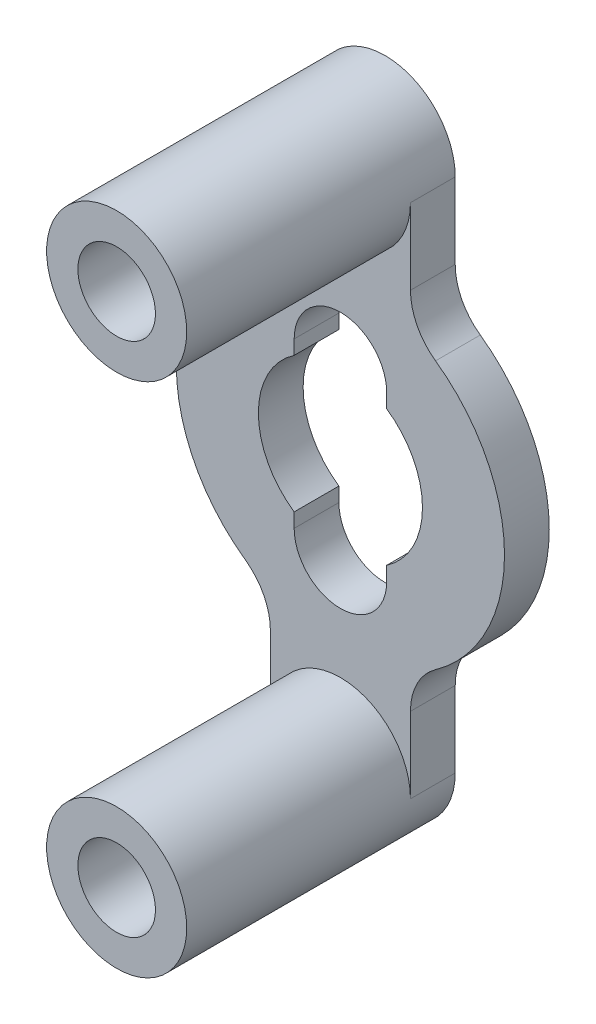
ISO-10303-21;
HEADER;
FILE_DESCRIPTION(('STEP AP214'),'2;1');
FILE_NAME('part.step','',(''),(''),'','','');
FILE_SCHEMA(('AUTOMOTIVE_DESIGN { 1 0 10303 214 1 1 1 1 }'));
ENDSEC;
DATA;
#1=APPLICATION_CONTEXT('core data for automotive mechanical design processes');
#2=APPLICATION_PROTOCOL_DEFINITION('international standard','automotive_design',2000,#1);
#3=PRODUCT_CONTEXT('',#1,'mechanical');
#4=PRODUCT('Part','Part','',(#3));
#5=PRODUCT_RELATED_PRODUCT_CATEGORY('part','',(#4));
#6=PRODUCT_DEFINITION_FORMATION('','',#4);
#7=PRODUCT_DEFINITION_CONTEXT('part definition',#1,'design');
#8=PRODUCT_DEFINITION('design','',#6,#7);
#9=PRODUCT_DEFINITION_SHAPE('','',#8);
#10=(LENGTH_UNIT() NAMED_UNIT(*) SI_UNIT(.MILLI.,.METRE.));
#11=(NAMED_UNIT(*) PLANE_ANGLE_UNIT() SI_UNIT($,.RADIAN.));
#12=(NAMED_UNIT(*) SI_UNIT($,.STERADIAN.) SOLID_ANGLE_UNIT());
#13=UNCERTAINTY_MEASURE_WITH_UNIT(LENGTH_MEASURE(1.E-05),#10,'distance_accuracy_value','');
#14=(GEOMETRIC_REPRESENTATION_CONTEXT(3) GLOBAL_UNCERTAINTY_ASSIGNED_CONTEXT((#13)) GLOBAL_UNIT_ASSIGNED_CONTEXT((#10,
#11,#12)) REPRESENTATION_CONTEXT('',''));
#15=CARTESIAN_POINT('',(0.,0.,0.));
#16=DIRECTION('',(0.,0.,1.));
#17=DIRECTION('',(1.,0.,0.));
#18=AXIS2_PLACEMENT_3D('',#15,#16,#17);
#19=CARTESIAN_POINT('',(-2.34789254737414,0.,1.5));
#20=DIRECTION('',(-1.,0.,0.));
#21=DIRECTION('',(0.,-1.,0.));
#22=AXIS2_PLACEMENT_3D('',#19,#20,#21);
#23=PLANE('',#22);
#24=DIRECTION('',(0.,1.,0.));
#25=VECTOR('',#24,1.);
#26=CARTESIAN_POINT('',(-2.34789254737414,0.,0.));
#27=LINE('',#26,#25);
#28=CARTESIAN_POINT('',(-2.34789254737414,6.11112349707388,0.));
#29=VERTEX_POINT('',#28);
#30=CARTESIAN_POINT('',(-2.34789254737414,8.65210745262587,0.));
#31=VERTEX_POINT('',#30);
#32=EDGE_CURVE('E265',#29,#31,#27,.T.);
#33=ORIENTED_EDGE('',*,*,#32,.F.);
#34=DIRECTION('',(0.,0.,-1.));
#35=VECTOR('',#34,1.);
#36=CARTESIAN_POINT('',(-2.34789254737414,6.11112349707388,1.5));
#37=LINE('',#36,#35);
#38=CARTESIAN_POINT('',(-2.34789254737414,6.11112349707388,1.5));
#39=VERTEX_POINT('',#38);
#40=EDGE_CURVE('E11',#39,#29,#37,.T.);
#41=ORIENTED_EDGE('',*,*,#40,.F.);
#42=DIRECTION('',(0.,1.,0.));
#43=VECTOR('',#42,1.);
#44=CARTESIAN_POINT('',(-2.34789254737414,0.,1.5));
#45=LINE('',#44,#43);
#46=CARTESIAN_POINT('',(-2.34789254737414,8.65210745262587,1.5));
#47=VERTEX_POINT('',#46);
#48=EDGE_CURVE('E312',#39,#47,#45,.T.);
#49=ORIENTED_EDGE('',*,*,#48,.T.);
#50=DIRECTION('',(0.,0.,-1.));
#51=VECTOR('',#50,1.);
#52=CARTESIAN_POINT('',(-2.34789254737414,8.65210745262587,1.5));
#53=LINE('',#52,#51);
#54=EDGE_CURVE('E228',#47,#31,#53,.T.);
#55=ORIENTED_EDGE('',*,*,#54,.T.);
#56=EDGE_LOOP('',(#33,#41,#49,#55));
#57=FACE_BOUND('',#56,.T.);
#58=ADVANCED_FACE('F35',(#57),#23,.T.);
#59=CARTESIAN_POINT('',(-4.34789254737414,6.11112349707388,1.5));
#60=DIRECTION('',(0.,0.,-1.));
#61=DIRECTION('',(-1.,0.,0.));
#62=AXIS2_PLACEMENT_3D('',#59,#60,#61);
#63=CYLINDRICAL_SURFACE('',#62,2.);
#64=CARTESIAN_POINT('',(-4.34789254737414,6.11112349707388,0.));
#65=DIRECTION('',(0.,0.,1.));
#66=DIRECTION('',(1.,0.,0.));
#67=AXIS2_PLACEMENT_3D('',#64,#65,#66);
#68=CIRCLE('',#67,2.);
#69=CARTESIAN_POINT('',(-3.18845453474103,4.48149056452084,0.));
#70=VERTEX_POINT('',#69);
#71=EDGE_CURVE('E262',#29,#70,#68,.F.);
#72=ORIENTED_EDGE('',*,*,#71,.T.);
#73=DIRECTION('',(0.,0.,-1.));
#74=VECTOR('',#73,1.);
#75=CARTESIAN_POINT('',(-3.18845453474103,4.48149056452084,1.5));
#76=LINE('',#75,#74);
#77=CARTESIAN_POINT('',(-3.18845453474103,4.48149056452084,1.5));
#78=VERTEX_POINT('',#77);
#79=EDGE_CURVE('E45',#78,#70,#76,.T.);
#80=ORIENTED_EDGE('',*,*,#79,.F.);
#81=CARTESIAN_POINT('',(-4.34789254737414,6.11112349707388,1.5));
#82=DIRECTION('',(0.,0.,1.));
#83=DIRECTION('',(1.,0.,0.));
#84=AXIS2_PLACEMENT_3D('',#81,#82,#83);
#85=CIRCLE('',#84,2.);
#86=EDGE_CURVE('E309',#39,#78,#85,.F.);
#87=ORIENTED_EDGE('',*,*,#86,.F.);
#88=ORIENTED_EDGE('',*,*,#40,.T.);
#89=EDGE_LOOP('',(#72,#80,#87,#88));
#90=FACE_BOUND('',#89,.T.);
#91=ADVANCED_FACE('F407',(#90),#63,.F.);
#92=CARTESIAN_POINT('',(0.,0.,1.5));
#93=DIRECTION('',(0.,0.,-1.));
#94=DIRECTION('',(-1.,0.,0.));
#95=AXIS2_PLACEMENT_3D('',#92,#93,#94);
#96=CYLINDRICAL_SURFACE('',#95,5.5);
#97=CARTESIAN_POINT('',(0.,0.,0.));
#98=DIRECTION('',(0.,0.,1.));
#99=DIRECTION('',(1.,0.,0.));
#100=AXIS2_PLACEMENT_3D('',#97,#98,#99);
#101=CIRCLE('',#100,5.5);
#102=CARTESIAN_POINT('',(-3.18845453474103,-4.48149056452084,0.));
#103=VERTEX_POINT('',#102);
#104=EDGE_CURVE('E259',#70,#103,#101,.T.);
#105=ORIENTED_EDGE('',*,*,#104,.T.);
#106=DIRECTION('',(0.,0.,-1.));
#107=VECTOR('',#106,1.);
#108=CARTESIAN_POINT('',(-3.18845453474103,-4.48149056452084,1.5));
#109=LINE('',#108,#107);
#110=CARTESIAN_POINT('',(-3.18845453474103,-4.48149056452084,1.5));
#111=VERTEX_POINT('',#110);
#112=EDGE_CURVE('E206',#111,#103,#109,.T.);
#113=ORIENTED_EDGE('',*,*,#112,.F.);
#114=CARTESIAN_POINT('',(0.,0.,1.5));
#115=DIRECTION('',(0.,0.,1.));
#116=DIRECTION('',(1.,0.,0.));
#117=AXIS2_PLACEMENT_3D('',#114,#115,#116);
#118=CIRCLE('',#117,5.5);
#119=EDGE_CURVE('E307',#78,#111,#118,.T.);
#120=ORIENTED_EDGE('',*,*,#119,.F.);
#121=ORIENTED_EDGE('',*,*,#79,.T.);
#122=EDGE_LOOP('',(#105,#113,#120,#121));
#123=FACE_BOUND('',#122,.T.);
#124=ADVANCED_FACE('F412',(#123),#96,.T.);
#125=CARTESIAN_POINT('',(-4.34789254737414,-6.11112349707387,1.5));
#126=DIRECTION('',(0.,0.,-1.));
#127=DIRECTION('',(-1.,0.,0.));
#128=AXIS2_PLACEMENT_3D('',#125,#126,#127);
#129=CYLINDRICAL_SURFACE('',#128,2.);
#130=CARTESIAN_POINT('',(-4.34789254737414,-6.11112349707387,0.));
#131=DIRECTION('',(0.,0.,1.));
#132=DIRECTION('',(1.,0.,0.));
#133=AXIS2_PLACEMENT_3D('',#130,#131,#132);
#134=CIRCLE('',#133,2.);
#135=CARTESIAN_POINT('',(-2.34789254737414,-6.11112349707387,0.));
#136=VERTEX_POINT('',#135);
#137=EDGE_CURVE('E256',#136,#103,#134,.T.);
#138=ORIENTED_EDGE('',*,*,#137,.F.);
#139=DIRECTION('',(0.,0.,-1.));
#140=VECTOR('',#139,1.);
#141=CARTESIAN_POINT('',(-2.34789254737414,-6.11112349707387,1.5));
#142=LINE('',#141,#140);
#143=CARTESIAN_POINT('',(-2.34789254737414,-6.11112349707387,1.5));
#144=VERTEX_POINT('',#143);
#145=EDGE_CURVE('E204',#144,#136,#142,.T.);
#146=ORIENTED_EDGE('',*,*,#145,.F.);
#147=CARTESIAN_POINT('',(-4.34789254737414,-6.11112349707387,1.5));
#148=DIRECTION('',(0.,0.,1.));
#149=DIRECTION('',(1.,0.,0.));
#150=AXIS2_PLACEMENT_3D('',#147,#148,#149);
#151=CIRCLE('',#150,2.);
#152=EDGE_CURVE('E304',#144,#111,#151,.T.);
#153=ORIENTED_EDGE('',*,*,#152,.T.);
#154=ORIENTED_EDGE('',*,*,#112,.T.);
#155=EDGE_LOOP('',(#138,#146,#153,#154));
#156=FACE_BOUND('',#155,.T.);
#157=ADVANCED_FACE('F546',(#156),#129,.F.);
#158=CARTESIAN_POINT('',(-2.34789254737414,0.,1.5));
#159=DIRECTION('',(-1.,0.,0.));
#160=DIRECTION('',(0.,-1.,0.));
#161=AXIS2_PLACEMENT_3D('',#158,#159,#160);
#162=PLANE('',#161);
#163=DIRECTION('',(0.,1.,0.));
#164=VECTOR('',#163,1.);
#165=CARTESIAN_POINT('',(-2.34789254737414,0.,0.));
#166=LINE('',#165,#164);
#167=CARTESIAN_POINT('',(-2.34789254737413,-8.65210745262587,0.));
#168=VERTEX_POINT('',#167);
#169=EDGE_CURVE('E253',#168,#136,#166,.T.);
#170=ORIENTED_EDGE('',*,*,#169,.F.);
#171=DIRECTION('',(0.,0.,-1.));
#172=VECTOR('',#171,1.);
#173=CARTESIAN_POINT('',(-2.34789254737413,-8.65210745262587,1.5));
#174=LINE('',#173,#172);
#175=CARTESIAN_POINT('',(-2.34789254737413,-8.65210745262587,1.5));
#176=VERTEX_POINT('',#175);
#177=EDGE_CURVE('E201',#176,#168,#174,.T.);
#178=ORIENTED_EDGE('',*,*,#177,.F.);
#179=DIRECTION('',(0.,1.,0.));
#180=VECTOR('',#179,1.);
#181=CARTESIAN_POINT('',(-2.34789254737414,0.,1.5));
#182=LINE('',#181,#180);
#183=EDGE_CURVE('E301',#176,#144,#182,.T.);
#184=ORIENTED_EDGE('',*,*,#183,.T.);
#185=ORIENTED_EDGE('',*,*,#145,.T.);
#186=EDGE_LOOP('',(#170,#178,#184,#185));
#187=FACE_BOUND('',#186,.T.);
#188=ADVANCED_FACE('F390',(#187),#162,.T.);
#189=CARTESIAN_POINT('',(2.34789254737413,0.,1.5));
#190=DIRECTION('',(-1.,0.,0.));
#191=DIRECTION('',(0.,-1.,0.));
#192=AXIS2_PLACEMENT_3D('',#189,#190,#191);
#193=PLANE('',#192);
#194=DIRECTION('',(0.,1.,0.));
#195=VECTOR('',#194,1.);
#196=CARTESIAN_POINT('',(2.34789254737413,0.,0.));
#197=LINE('',#196,#195);
#198=CARTESIAN_POINT('',(2.34789254737414,-8.65210745262586,0.));
#199=VERTEX_POINT('',#198);
#200=CARTESIAN_POINT('',(2.34789254737414,-6.11112349707387,0.));
#201=VERTEX_POINT('',#200);
#202=EDGE_CURVE('E250',#199,#201,#197,.T.);
#203=ORIENTED_EDGE('',*,*,#202,.T.);
#204=DIRECTION('',(0.,0.,-1.));
#205=VECTOR('',#204,1.);
#206=CARTESIAN_POINT('',(2.34789254737414,-6.11112349707387,1.5));
#207=LINE('',#206,#205);
#208=CARTESIAN_POINT('',(2.34789254737414,-6.11112349707387,1.5));
#209=VERTEX_POINT('',#208);
#210=EDGE_CURVE('E192',#209,#201,#207,.T.);
#211=ORIENTED_EDGE('',*,*,#210,.F.);
#212=DIRECTION('',(0.,1.,0.));
#213=VECTOR('',#212,1.);
#214=CARTESIAN_POINT('',(2.34789254737413,0.,1.5));
#215=LINE('',#214,#213);
#216=CARTESIAN_POINT('',(2.34789254737414,-8.65210745262587,1.5));
#217=VERTEX_POINT('',#216);
#218=EDGE_CURVE('E185',#217,#209,#215,.T.);
#219=ORIENTED_EDGE('',*,*,#218,.F.);
#220=DIRECTION('',(0.,0.,-1.));
#221=VECTOR('',#220,1.);
#222=CARTESIAN_POINT('',(2.34789254737414,-8.65210745262587,1.5));
#223=LINE('',#222,#221);
#224=EDGE_CURVE('E194',#217,#199,#223,.T.);
#225=ORIENTED_EDGE('',*,*,#224,.T.);
#226=EDGE_LOOP('',(#203,#211,#219,#225));
#227=FACE_BOUND('',#226,.T.);
#228=ADVANCED_FACE('F385',(#227),#193,.F.);
#229=CARTESIAN_POINT('',(4.34789254737414,-6.11112349707387,1.5));
#230=DIRECTION('',(0.,0.,-1.));
#231=DIRECTION('',(-1.,0.,0.));
#232=AXIS2_PLACEMENT_3D('',#229,#230,#231);
#233=CYLINDRICAL_SURFACE('',#232,2.);
#234=CARTESIAN_POINT('',(4.34789254737414,-6.11112349707387,0.));
#235=DIRECTION('',(0.,0.,1.));
#236=DIRECTION('',(1.,0.,0.));
#237=AXIS2_PLACEMENT_3D('',#234,#235,#236);
#238=CIRCLE('',#237,2.);
#239=CARTESIAN_POINT('',(3.18845453474103,-4.48149056452084,0.));
#240=VERTEX_POINT('',#239);
#241=EDGE_CURVE('E191',#201,#240,#238,.F.);
#242=ORIENTED_EDGE('',*,*,#241,.T.);
#243=DIRECTION('',(0.,0.,-1.));
#244=VECTOR('',#243,1.);
#245=CARTESIAN_POINT('',(3.18845453474103,-4.48149056452084,1.5));
#246=LINE('',#245,#244);
#247=CARTESIAN_POINT('',(3.18845453474103,-4.48149056452084,1.5));
#248=VERTEX_POINT('',#247);
#249=EDGE_CURVE('E172',#248,#240,#246,.T.);
#250=ORIENTED_EDGE('',*,*,#249,.F.);
#251=CARTESIAN_POINT('',(4.34789254737414,-6.11112349707387,1.5));
#252=DIRECTION('',(0.,0.,1.));
#253=DIRECTION('',(1.,0.,0.));
#254=AXIS2_PLACEMENT_3D('',#251,#252,#253);
#255=CIRCLE('',#254,2.);
#256=EDGE_CURVE('E178',#209,#248,#255,.F.);
#257=ORIENTED_EDGE('',*,*,#256,.F.);
#258=ORIENTED_EDGE('',*,*,#210,.T.);
#259=EDGE_LOOP('',(#242,#250,#257,#258));
#260=FACE_BOUND('',#259,.T.);
#261=ADVANCED_FACE('F190',(#260),#233,.F.);
#262=CARTESIAN_POINT('',(0.,0.,1.5));
#263=DIRECTION('',(0.,0.,-1.));
#264=DIRECTION('',(-1.,0.,0.));
#265=AXIS2_PLACEMENT_3D('',#262,#263,#264);
#266=CYLINDRICAL_SURFACE('',#265,5.5);
#267=CARTESIAN_POINT('',(0.,0.,0.));
#268=DIRECTION('',(0.,0.,1.));
#269=DIRECTION('',(1.,0.,0.));
#270=AXIS2_PLACEMENT_3D('',#267,#268,#269);
#271=CIRCLE('',#270,5.5);
#272=CARTESIAN_POINT('',(3.18845453474103,4.48149056452084,0.));
#273=VERTEX_POINT('',#272);
#274=EDGE_CURVE('E247',#240,#273,#271,.T.);
#275=ORIENTED_EDGE('',*,*,#274,.T.);
#276=DIRECTION('',(0.,0.,-1.));
#277=VECTOR('',#276,1.);
#278=CARTESIAN_POINT('',(3.18845453474103,4.48149056452084,1.5));
#279=LINE('',#278,#277);
#280=CARTESIAN_POINT('',(3.18845453474103,4.48149056452084,1.5));
#281=VERTEX_POINT('',#280);
#282=EDGE_CURVE('E174',#281,#273,#279,.T.);
#283=ORIENTED_EDGE('',*,*,#282,.F.);
#284=CARTESIAN_POINT('',(0.,0.,1.5));
#285=DIRECTION('',(0.,0.,1.));
#286=DIRECTION('',(1.,0.,0.));
#287=AXIS2_PLACEMENT_3D('',#284,#285,#286);
#288=CIRCLE('',#287,5.5);
#289=EDGE_CURVE('E167',#248,#281,#288,.T.);
#290=ORIENTED_EDGE('',*,*,#289,.F.);
#291=ORIENTED_EDGE('',*,*,#249,.T.);
#292=EDGE_LOOP('',(#275,#283,#290,#291));
#293=FACE_BOUND('',#292,.T.);
#294=ADVANCED_FACE('F170',(#293),#266,.T.);
#295=CARTESIAN_POINT('',(4.34789254737414,6.11112349707388,1.5));
#296=DIRECTION('',(0.,0.,-1.));
#297=DIRECTION('',(-1.,0.,0.));
#298=AXIS2_PLACEMENT_3D('',#295,#296,#297);
#299=CYLINDRICAL_SURFACE('',#298,2.);
#300=CARTESIAN_POINT('',(4.34789254737414,6.11112349707388,0.));
#301=DIRECTION('',(0.,0.,1.));
#302=DIRECTION('',(1.,0.,0.));
#303=AXIS2_PLACEMENT_3D('',#300,#301,#302);
#304=CIRCLE('',#303,2.);
#305=CARTESIAN_POINT('',(2.34789254737414,6.11112349707388,0.));
#306=VERTEX_POINT('',#305);
#307=EDGE_CURVE('E244',#306,#273,#304,.T.);
#308=ORIENTED_EDGE('',*,*,#307,.F.);
#309=DIRECTION('',(0.,0.,-1.));
#310=VECTOR('',#309,1.);
#311=CARTESIAN_POINT('',(2.34789254737414,6.11112349707388,1.5));
#312=LINE('',#311,#310);
#313=CARTESIAN_POINT('',(2.34789254737414,6.11112349707388,1.5));
#314=VERTEX_POINT('',#313);
#315=EDGE_CURVE('E54',#314,#306,#312,.T.);
#316=ORIENTED_EDGE('',*,*,#315,.F.);
#317=CARTESIAN_POINT('',(4.34789254737414,6.11112349707388,1.5));
#318=DIRECTION('',(0.,0.,1.));
#319=DIRECTION('',(1.,0.,0.));
#320=AXIS2_PLACEMENT_3D('',#317,#318,#319);
#321=CIRCLE('',#320,2.);
#322=EDGE_CURVE('E177',#314,#281,#321,.T.);
#323=ORIENTED_EDGE('',*,*,#322,.T.);
#324=ORIENTED_EDGE('',*,*,#282,.T.);
#325=EDGE_LOOP('',(#308,#316,#323,#324));
#326=FACE_BOUND('',#325,.T.);
#327=ADVANCED_FACE('F394',(#326),#299,.F.);
#328=CARTESIAN_POINT('',(2.34789254737414,0.,1.5));
#329=DIRECTION('',(-1.,0.,0.));
#330=DIRECTION('',(0.,-1.,0.));
#331=AXIS2_PLACEMENT_3D('',#328,#329,#330);
#332=PLANE('',#331);
#333=DIRECTION('',(0.,1.,0.));
#334=VECTOR('',#333,1.);
#335=CARTESIAN_POINT('',(2.34789254737414,0.,0.));
#336=LINE('',#335,#334);
#337=CARTESIAN_POINT('',(2.34789254737414,8.65210745262587,0.));
#338=VERTEX_POINT('',#337);
#339=EDGE_CURVE('E241',#306,#338,#336,.T.);
#340=ORIENTED_EDGE('',*,*,#339,.T.);
#341=DIRECTION('',(0.,0.,-1.));
#342=VECTOR('',#341,1.);
#343=CARTESIAN_POINT('',(2.34789254737414,8.65210745262587,1.5));
#344=LINE('',#343,#342);
#345=CARTESIAN_POINT('',(2.34789254737414,8.65210745262587,1.5));
#346=VERTEX_POINT('',#345);
#347=EDGE_CURVE('E232',#346,#338,#344,.T.);
#348=ORIENTED_EDGE('',*,*,#347,.F.);
#349=DIRECTION('',(0.,1.,0.));
#350=VECTOR('',#349,1.);
#351=CARTESIAN_POINT('',(2.34789254737414,0.,1.5));
#352=LINE('',#351,#350);
#353=EDGE_CURVE('E293',#314,#346,#352,.T.);
#354=ORIENTED_EDGE('',*,*,#353,.F.);
#355=ORIENTED_EDGE('',*,*,#315,.T.);
#356=EDGE_LOOP('',(#340,#348,#354,#355));
#357=FACE_BOUND('',#356,.T.);
#358=ADVANCED_FACE('F396',(#357),#332,.F.);
#359=CARTESIAN_POINT('',(0.,0.,1.5));
#360=DIRECTION('',(0.,0.,-1.));
#361=DIRECTION('',(-1.,0.,0.));
#362=AXIS2_PLACEMENT_3D('',#359,#360,#361);
#363=CYLINDRICAL_SURFACE('',#362,2.75);
#364=CARTESIAN_POINT('',(0.,0.,0.));
#365=DIRECTION('',(0.,0.,1.));
#366=DIRECTION('',(1.,0.,0.));
#367=AXIS2_PLACEMENT_3D('',#364,#365,#366);
#368=CIRCLE('',#367,2.75);
#369=CARTESIAN_POINT('',(-1.55,2.27156333832011,0.));
#370=VERTEX_POINT('',#369);
#371=CARTESIAN_POINT('',(-1.55,-2.27156333832011,0.));
#372=VERTEX_POINT('',#371);
#373=EDGE_CURVE('E287',#370,#372,#368,.T.);
#374=ORIENTED_EDGE('',*,*,#373,.F.);
#375=DIRECTION('',(0.,0.,-1.));
#376=VECTOR('',#375,1.);
#377=CARTESIAN_POINT('',(-1.55,2.27156333832011,1.5));
#378=LINE('',#377,#376);
#379=CARTESIAN_POINT('',(-1.55,2.27156333832011,1.5));
#380=VERTEX_POINT('',#379);
#381=EDGE_CURVE('E39',#380,#370,#378,.T.);
#382=ORIENTED_EDGE('',*,*,#381,.F.);
#383=CARTESIAN_POINT('',(0.,0.,1.5));
#384=DIRECTION('',(0.,0.,1.));
#385=DIRECTION('',(1.,0.,0.));
#386=AXIS2_PLACEMENT_3D('',#383,#384,#385);
#387=CIRCLE('',#386,2.75);
#388=CARTESIAN_POINT('',(-1.55,-2.27156333832011,1.5));
#389=VERTEX_POINT('',#388);
#390=EDGE_CURVE('E243',#380,#389,#387,.T.);
#391=ORIENTED_EDGE('',*,*,#390,.T.);
#392=DIRECTION('',(0.,0.,-1.));
#393=VECTOR('',#392,1.);
#394=CARTESIAN_POINT('',(-1.55,-2.27156333832011,1.5));
#395=LINE('',#394,#393);
#396=EDGE_CURVE('E210',#389,#372,#395,.T.);
#397=ORIENTED_EDGE('',*,*,#396,.T.);
#398=EDGE_LOOP('',(#374,#382,#391,#397));
#399=FACE_BOUND('',#398,.T.);
#400=ADVANCED_FACE('F37',(#399),#363,.F.);
#401=CARTESIAN_POINT('',(-1.55,0.,1.5));
#402=DIRECTION('',(-1.,0.,0.));
#403=DIRECTION('',(0.,0.,1.));
#404=AXIS2_PLACEMENT_3D('',#401,#402,#403);
#405=PLANE('',#404);
#406=DIRECTION('',(0.,1.,0.));
#407=VECTOR('',#406,1.);
#408=CARTESIAN_POINT('',(-1.55,0.,0.));
#409=LINE('',#408,#407);
#410=CARTESIAN_POINT('',(-1.55,2.75,0.));
#411=VERTEX_POINT('',#410);
#412=EDGE_CURVE('E285',#370,#411,#409,.T.);
#413=ORIENTED_EDGE('',*,*,#412,.T.);
#414=DIRECTION('',(0.,0.,-1.));
#415=VECTOR('',#414,1.);
#416=CARTESIAN_POINT('',(-1.55,2.75,1.5));
#417=LINE('',#416,#415);
#418=CARTESIAN_POINT('',(-1.55,2.75,1.5));
#419=VERTEX_POINT('',#418);
#420=EDGE_CURVE('E222',#419,#411,#417,.T.);
#421=ORIENTED_EDGE('',*,*,#420,.F.);
#422=DIRECTION('',(0.,1.,0.));
#423=VECTOR('',#422,1.);
#424=CARTESIAN_POINT('',(-1.55,0.,1.5));
#425=LINE('',#424,#423);
#426=EDGE_CURVE('E330',#380,#419,#425,.T.);
#427=ORIENTED_EDGE('',*,*,#426,.F.);
#428=ORIENTED_EDGE('',*,*,#381,.T.);
#429=EDGE_LOOP('',(#413,#421,#427,#428));
#430=FACE_BOUND('',#429,.T.);
#431=ADVANCED_FACE('F403',(#430),#405,.F.);
#432=CARTESIAN_POINT('',(0.,2.75,1.5));
#433=DIRECTION('',(0.,0.,-1.));
#434=DIRECTION('',(-1.,0.,0.));
#435=AXIS2_PLACEMENT_3D('',#432,#433,#434);
#436=CYLINDRICAL_SURFACE('',#435,1.55);
#437=CARTESIAN_POINT('',(0.,2.75,0.));
#438=DIRECTION('',(0.,0.,1.));
#439=DIRECTION('',(1.,0.,0.));
#440=AXIS2_PLACEMENT_3D('',#437,#438,#439);
#441=CIRCLE('',#440,1.55);
#442=CARTESIAN_POINT('',(1.55,2.75,0.));
#443=VERTEX_POINT('',#442);
#444=EDGE_CURVE('E282',#443,#411,#441,.T.);
#445=ORIENTED_EDGE('',*,*,#444,.F.);
#446=DIRECTION('',(0.,0.,-1.));
#447=VECTOR('',#446,1.);
#448=CARTESIAN_POINT('',(1.55,2.75,1.5));
#449=LINE('',#448,#447);
#450=CARTESIAN_POINT('',(1.55,2.75,1.5));
#451=VERTEX_POINT('',#450);
#452=EDGE_CURVE('E221',#451,#443,#449,.T.);
#453=ORIENTED_EDGE('',*,*,#452,.F.);
#454=CARTESIAN_POINT('',(0.,2.75,1.5));
#455=DIRECTION('',(0.,0.,1.));
#456=DIRECTION('',(1.,0.,0.));
#457=AXIS2_PLACEMENT_3D('',#454,#455,#456);
#458=CIRCLE('',#457,1.55);
#459=EDGE_CURVE('E328',#451,#419,#458,.T.);
#460=ORIENTED_EDGE('',*,*,#459,.T.);
#461=ORIENTED_EDGE('',*,*,#420,.T.);
#462=EDGE_LOOP('',(#445,#453,#460,#461));
#463=FACE_BOUND('',#462,.T.);
#464=ADVANCED_FACE('F436',(#463),#436,.F.);
#465=CARTESIAN_POINT('',(1.55,0.,1.5));
#466=DIRECTION('',(-1.,0.,0.));
#467=DIRECTION('',(0.,0.,1.));
#468=AXIS2_PLACEMENT_3D('',#465,#466,#467);
#469=PLANE('',#468);
#470=DIRECTION('',(0.,1.,0.));
#471=VECTOR('',#470,1.);
#472=CARTESIAN_POINT('',(1.55,0.,0.));
#473=LINE('',#472,#471);
#474=CARTESIAN_POINT('',(1.55,2.27156333832011,0.));
#475=VERTEX_POINT('',#474);
#476=EDGE_CURVE('E279',#475,#443,#473,.T.);
#477=ORIENTED_EDGE('',*,*,#476,.F.);
#478=DIRECTION('',(0.,0.,-1.));
#479=VECTOR('',#478,1.);
#480=CARTESIAN_POINT('',(1.55,2.27156333832011,1.5));
#481=LINE('',#480,#479);
#482=CARTESIAN_POINT('',(1.55,2.27156333832011,1.5));
#483=VERTEX_POINT('',#482);
#484=EDGE_CURVE('E219',#483,#475,#481,.T.);
#485=ORIENTED_EDGE('',*,*,#484,.F.);
#486=DIRECTION('',(0.,1.,0.));
#487=VECTOR('',#486,1.);
#488=CARTESIAN_POINT('',(1.55,0.,1.5));
#489=LINE('',#488,#487);
#490=EDGE_CURVE('E325',#483,#451,#489,.T.);
#491=ORIENTED_EDGE('',*,*,#490,.T.);
#492=ORIENTED_EDGE('',*,*,#452,.T.);
#493=EDGE_LOOP('',(#477,#485,#491,#492));
#494=FACE_BOUND('',#493,.T.);
#495=ADVANCED_FACE('F432',(#494),#469,.T.);
#496=CARTESIAN_POINT('',(0.,0.,1.5));
#497=DIRECTION('',(0.,0.,-1.));
#498=DIRECTION('',(-1.,0.,0.));
#499=AXIS2_PLACEMENT_3D('',#496,#497,#498);
#500=CYLINDRICAL_SURFACE('',#499,2.75);
#501=CARTESIAN_POINT('',(0.,0.,0.));
#502=DIRECTION('',(0.,0.,1.));
#503=DIRECTION('',(1.,0.,0.));
#504=AXIS2_PLACEMENT_3D('',#501,#502,#503);
#505=CIRCLE('',#504,2.75);
#506=CARTESIAN_POINT('',(1.55,-2.27156333832011,0.));
#507=VERTEX_POINT('',#506);
#508=EDGE_CURVE('E276',#507,#475,#505,.T.);
#509=ORIENTED_EDGE('',*,*,#508,.F.);
#510=DIRECTION('',(0.,0.,-1.));
#511=VECTOR('',#510,1.);
#512=CARTESIAN_POINT('',(1.55,-2.27156333832011,1.5));
#513=LINE('',#512,#511);
#514=CARTESIAN_POINT('',(1.55,-2.27156333832011,1.5));
#515=VERTEX_POINT('',#514);
#516=EDGE_CURVE('E217',#515,#507,#513,.T.);
#517=ORIENTED_EDGE('',*,*,#516,.F.);
#518=CARTESIAN_POINT('',(0.,0.,1.5));
#519=DIRECTION('',(0.,0.,1.));
#520=DIRECTION('',(1.,0.,0.));
#521=AXIS2_PLACEMENT_3D('',#518,#519,#520);
#522=CIRCLE('',#521,2.75);
#523=EDGE_CURVE('E322',#515,#483,#522,.T.);
#524=ORIENTED_EDGE('',*,*,#523,.T.);
#525=ORIENTED_EDGE('',*,*,#484,.T.);
#526=EDGE_LOOP('',(#509,#517,#524,#525));
#527=FACE_BOUND('',#526,.T.);
#528=ADVANCED_FACE('F428',(#527),#500,.F.);
#529=CARTESIAN_POINT('',(1.55,0.,1.5));
#530=DIRECTION('',(-1.,0.,0.));
#531=DIRECTION('',(0.,-1.,0.));
#532=AXIS2_PLACEMENT_3D('',#529,#530,#531);
#533=PLANE('',#532);
#534=DIRECTION('',(0.,1.,0.));
#535=VECTOR('',#534,1.);
#536=CARTESIAN_POINT('',(1.55,0.,0.));
#537=LINE('',#536,#535);
#538=CARTESIAN_POINT('',(1.55,-2.75,0.));
#539=VERTEX_POINT('',#538);
#540=EDGE_CURVE('E273',#539,#507,#537,.T.);
#541=ORIENTED_EDGE('',*,*,#540,.F.);
#542=DIRECTION('',(0.,0.,-1.));
#543=VECTOR('',#542,1.);
#544=CARTESIAN_POINT('',(1.55,-2.75,1.5));
#545=LINE('',#544,#543);
#546=CARTESIAN_POINT('',(1.55,-2.75,1.5));
#547=VERTEX_POINT('',#546);
#548=EDGE_CURVE('E215',#547,#539,#545,.T.);
#549=ORIENTED_EDGE('',*,*,#548,.F.);
#550=DIRECTION('',(0.,1.,0.));
#551=VECTOR('',#550,1.);
#552=CARTESIAN_POINT('',(1.55,0.,1.5));
#553=LINE('',#552,#551);
#554=EDGE_CURVE('E319',#547,#515,#553,.T.);
#555=ORIENTED_EDGE('',*,*,#554,.T.);
#556=ORIENTED_EDGE('',*,*,#516,.T.);
#557=EDGE_LOOP('',(#541,#549,#555,#556));
#558=FACE_BOUND('',#557,.T.);
#559=ADVANCED_FACE('F424',(#558),#533,.T.);
#560=CARTESIAN_POINT('',(0.,-2.75,1.5));
#561=DIRECTION('',(0.,0.,-1.));
#562=DIRECTION('',(-1.,0.,0.));
#563=AXIS2_PLACEMENT_3D('',#560,#561,#562);
#564=CYLINDRICAL_SURFACE('',#563,1.55);
#565=CARTESIAN_POINT('',(0.,-2.75,0.));
#566=DIRECTION('',(0.,0.,1.));
#567=DIRECTION('',(1.,0.,0.));
#568=AXIS2_PLACEMENT_3D('',#565,#566,#567);
#569=CIRCLE('',#568,1.55);
#570=CARTESIAN_POINT('',(-1.55,-2.75,0.));
#571=VERTEX_POINT('',#570);
#572=EDGE_CURVE('E270',#571,#539,#569,.T.);
#573=ORIENTED_EDGE('',*,*,#572,.F.);
#574=DIRECTION('',(0.,0.,-1.));
#575=VECTOR('',#574,1.);
#576=CARTESIAN_POINT('',(-1.55,-2.75,1.5));
#577=LINE('',#576,#575);
#578=CARTESIAN_POINT('',(-1.55,-2.75,1.5));
#579=VERTEX_POINT('',#578);
#580=EDGE_CURVE('E212',#579,#571,#577,.T.);
#581=ORIENTED_EDGE('',*,*,#580,.F.);
#582=CARTESIAN_POINT('',(0.,-2.75,1.5));
#583=DIRECTION('',(0.,0.,1.));
#584=DIRECTION('',(1.,0.,0.));
#585=AXIS2_PLACEMENT_3D('',#582,#583,#584);
#586=CIRCLE('',#585,1.55);
#587=EDGE_CURVE('E316',#579,#547,#586,.T.);
#588=ORIENTED_EDGE('',*,*,#587,.T.);
#589=ORIENTED_EDGE('',*,*,#548,.T.);
#590=EDGE_LOOP('',(#573,#581,#588,#589));
#591=FACE_BOUND('',#590,.T.);
#592=ADVANCED_FACE('F420',(#591),#564,.F.);
#593=CARTESIAN_POINT('',(-1.55,0.,1.5));
#594=DIRECTION('',(-1.,0.,0.));
#595=DIRECTION('',(0.,-1.,0.));
#596=AXIS2_PLACEMENT_3D('',#593,#594,#595);
#597=PLANE('',#596);
#598=DIRECTION('',(0.,1.,0.));
#599=VECTOR('',#598,1.);
#600=CARTESIAN_POINT('',(-1.55,0.,0.));
#601=LINE('',#600,#599);
#602=EDGE_CURVE('E267',#571,#372,#601,.T.);
#603=ORIENTED_EDGE('',*,*,#602,.T.);
#604=ORIENTED_EDGE('',*,*,#396,.F.);
#605=DIRECTION('',(0.,1.,0.));
#606=VECTOR('',#605,1.);
#607=CARTESIAN_POINT('',(-1.55,0.,1.5));
#608=LINE('',#607,#606);
#609=EDGE_CURVE('E314',#579,#389,#608,.T.);
#610=ORIENTED_EDGE('',*,*,#609,.F.);
#611=ORIENTED_EDGE('',*,*,#580,.T.);
#612=EDGE_LOOP('',(#603,#604,#610,#611));
#613=FACE_BOUND('',#612,.T.);
#614=ADVANCED_FACE('F417',(#613),#597,.F.);
#615=CARTESIAN_POINT('',(0.,0.,1.5));
#616=DIRECTION('',(0.,0.,1.));
#617=DIRECTION('',(1.,0.,0.));
#618=AXIS2_PLACEMENT_3D('',#615,#616,#617);
#619=PLANE('',#618);
#620=ORIENTED_EDGE('',*,*,#390,.F.);
#621=ORIENTED_EDGE('',*,*,#426,.T.);
#622=ORIENTED_EDGE('',*,*,#459,.F.);
#623=ORIENTED_EDGE('',*,*,#490,.F.);
#624=ORIENTED_EDGE('',*,*,#523,.F.);
#625=ORIENTED_EDGE('',*,*,#554,.F.);
#626=ORIENTED_EDGE('',*,*,#587,.F.);
#627=ORIENTED_EDGE('',*,*,#609,.T.);
#628=EDGE_LOOP('',(#620,#621,#622,#623,#624,#625,#626,#627));
#629=FACE_BOUND('',#628,.T.);
#630=ORIENTED_EDGE('',*,*,#48,.F.);
#631=ORIENTED_EDGE('',*,*,#86,.T.);
#632=ORIENTED_EDGE('',*,*,#119,.T.);
#633=ORIENTED_EDGE('',*,*,#152,.F.);
#634=ORIENTED_EDGE('',*,*,#183,.F.);
#635=CARTESIAN_POINT('',(0.,-8.65210745262587,1.5));
#636=DIRECTION('',(0.,0.,1.));
#637=DIRECTION('',(1.,0.,0.));
#638=AXIS2_PLACEMENT_3D('',#635,#636,#637);
#639=CIRCLE('',#638,2.34789254737414);
#640=EDGE_CURVE('E298',#217,#176,#639,.T.);
#641=ORIENTED_EDGE('',*,*,#640,.F.);
#642=ORIENTED_EDGE('',*,*,#218,.T.);
#643=ORIENTED_EDGE('',*,*,#256,.T.);
#644=ORIENTED_EDGE('',*,*,#289,.T.);
#645=ORIENTED_EDGE('',*,*,#322,.F.);
#646=ORIENTED_EDGE('',*,*,#353,.T.);
#647=CARTESIAN_POINT('',(0.,8.65210745262587,1.5));
#648=DIRECTION('',(0.,0.,1.));
#649=DIRECTION('',(1.,0.,0.));
#650=AXIS2_PLACEMENT_3D('',#647,#648,#649);
#651=CIRCLE('',#650,2.34789254737414);
#652=EDGE_CURVE('E213',#47,#346,#651,.T.);
#653=ORIENTED_EDGE('',*,*,#652,.F.);
#654=EDGE_LOOP('',(#630,#631,#632,#633,#634,#641,#642,#643,#644,#645,#646,#653));
#655=FACE_BOUND('',#654,.T.);
#656=ADVANCED_FACE('F182',(#629,#655),#619,.T.);
#657=CARTESIAN_POINT('',(0.,0.,0.));
#658=DIRECTION('',(0.,0.,1.));
#659=DIRECTION('',(1.,0.,0.));
#660=AXIS2_PLACEMENT_3D('',#657,#658,#659);
#661=PLANE('',#660);
#662=ORIENTED_EDGE('',*,*,#373,.T.);
#663=ORIENTED_EDGE('',*,*,#602,.F.);
#664=ORIENTED_EDGE('',*,*,#572,.T.);
#665=ORIENTED_EDGE('',*,*,#540,.T.);
#666=ORIENTED_EDGE('',*,*,#508,.T.);
#667=ORIENTED_EDGE('',*,*,#476,.T.);
#668=ORIENTED_EDGE('',*,*,#444,.T.);
#669=ORIENTED_EDGE('',*,*,#412,.F.);
#670=EDGE_LOOP('',(#662,#663,#664,#665,#666,#667,#668,#669));
#671=FACE_BOUND('',#670,.T.);
#672=ORIENTED_EDGE('',*,*,#32,.T.);
#673=CARTESIAN_POINT('',(0.,8.65210745262587,0.));
#674=DIRECTION('',(0.,0.,1.));
#675=DIRECTION('',(1.,0.,0.));
#676=AXIS2_PLACEMENT_3D('',#673,#674,#675);
#677=CIRCLE('',#676,2.34789254737414);
#678=EDGE_CURVE('E117',#338,#31,#677,.T.);
#679=ORIENTED_EDGE('',*,*,#678,.F.);
#680=ORIENTED_EDGE('',*,*,#339,.F.);
#681=ORIENTED_EDGE('',*,*,#307,.T.);
#682=ORIENTED_EDGE('',*,*,#274,.F.);
#683=ORIENTED_EDGE('',*,*,#241,.F.);
#684=ORIENTED_EDGE('',*,*,#202,.F.);
#685=CARTESIAN_POINT('',(0.,-8.65210745262587,0.));
#686=DIRECTION('',(0.,0.,1.));
#687=DIRECTION('',(1.,0.,0.));
#688=AXIS2_PLACEMENT_3D('',#685,#686,#687);
#689=CIRCLE('',#688,2.34789254737414);
#690=EDGE_CURVE('E333',#168,#199,#689,.T.);
#691=ORIENTED_EDGE('',*,*,#690,.F.);
#692=ORIENTED_EDGE('',*,*,#169,.T.);
#693=ORIENTED_EDGE('',*,*,#137,.T.);
#694=ORIENTED_EDGE('',*,*,#104,.F.);
#695=ORIENTED_EDGE('',*,*,#71,.F.);
#696=EDGE_LOOP('',(#672,#679,#680,#681,#682,#683,#684,#691,#692,#693,#694,#695));
#697=FACE_BOUND('',#696,.T.);
#698=CARTESIAN_POINT('',(0.,-8.65210745262587,0.));
#699=DIRECTION('',(0.,0.,1.));
#700=DIRECTION('',(1.,0.,0.));
#701=AXIS2_PLACEMENT_3D('',#698,#699,#700);
#702=CIRCLE('',#701,1.3);
#703=CARTESIAN_POINT('',(1.3,-8.65210745262587,0.));
#704=VERTEX_POINT('',#703);
#705=EDGE_CURVE('E337',#704,#704,#702,.T.);
#706=ORIENTED_EDGE('',*,*,#705,.T.);
#707=EDGE_LOOP('',(#706));
#708=FACE_BOUND('',#707,.T.);
#709=CARTESIAN_POINT('',(0.,8.65210745262587,0.));
#710=DIRECTION('',(0.,0.,1.));
#711=DIRECTION('',(1.,0.,0.));
#712=AXIS2_PLACEMENT_3D('',#709,#710,#711);
#713=CIRCLE('',#712,1.3);
#714=CARTESIAN_POINT('',(1.3,8.65210745262587,0.));
#715=VERTEX_POINT('',#714);
#716=EDGE_CURVE('E347',#715,#715,#713,.T.);
#717=ORIENTED_EDGE('',*,*,#716,.T.);
#718=EDGE_LOOP('',(#717));
#719=FACE_BOUND('',#718,.T.);
#720=ADVANCED_FACE('F392',(#671,#697,#708,#719),#661,.F.);
#721=CARTESIAN_POINT('',(0.,-8.65210745262587,9.));
#722=DIRECTION('',(0.,0.,-1.));
#723=DIRECTION('',(-1.,0.,0.));
#724=AXIS2_PLACEMENT_3D('',#721,#722,#723);
#725=CYLINDRICAL_SURFACE('',#724,1.3);
#726=CARTESIAN_POINT('',(0.,-8.65210745262587,9.));
#727=DIRECTION('',(0.,0.,1.));
#728=DIRECTION('',(1.,0.,0.));
#729=AXIS2_PLACEMENT_3D('',#726,#727,#728);
#730=CIRCLE('',#729,1.3);
#731=CARTESIAN_POINT('',(1.3,-8.65210745262587,9.));
#732=VERTEX_POINT('',#731);
#733=EDGE_CURVE('E336',#732,#732,#730,.T.);
#734=ORIENTED_EDGE('',*,*,#733,.T.);
#735=EDGE_LOOP('',(#734));
#736=FACE_BOUND('',#735,.T.);
#737=ORIENTED_EDGE('',*,*,#705,.F.);
#738=EDGE_LOOP('',(#737));
#739=FACE_BOUND('',#738,.T.);
#740=ADVANCED_FACE('F462',(#736,#739),#725,.F.);
#741=CARTESIAN_POINT('',(0.,-8.65210745262587,9.));
#742=DIRECTION('',(0.,0.,-1.));
#743=DIRECTION('',(-1.,0.,0.));
#744=AXIS2_PLACEMENT_3D('',#741,#742,#743);
#745=CYLINDRICAL_SURFACE('',#744,2.34789254737414);
#746=ORIENTED_EDGE('',*,*,#177,.T.);
#747=ORIENTED_EDGE('',*,*,#690,.T.);
#748=ORIENTED_EDGE('',*,*,#224,.F.);
#749=ORIENTED_EDGE('',*,*,#640,.T.);
#750=EDGE_LOOP('',(#746,#747,#748,#749));
#751=FACE_BOUND('',#750,.T.);
#752=CARTESIAN_POINT('',(0.,-8.65210745262587,9.));
#753=DIRECTION('',(0.,0.,1.));
#754=DIRECTION('',(1.,0.,0.));
#755=AXIS2_PLACEMENT_3D('',#752,#753,#754);
#756=CIRCLE('',#755,2.34789254737414);
#757=CARTESIAN_POINT('',(2.34789254737414,-8.65210745262587,9.));
#758=VERTEX_POINT('',#757);
#759=EDGE_CURVE('E290',#758,#758,#756,.T.);
#760=ORIENTED_EDGE('',*,*,#759,.F.);
#761=EDGE_LOOP('',(#760));
#762=FACE_BOUND('',#761,.T.);
#763=ADVANCED_FACE('F381',(#751,#762),#745,.T.);
#764=CARTESIAN_POINT('',(0.,0.,9.));
#765=DIRECTION('',(0.,0.,1.));
#766=DIRECTION('',(1.,0.,0.));
#767=AXIS2_PLACEMENT_3D('',#764,#765,#766);
#768=PLANE('',#767);
#769=ORIENTED_EDGE('',*,*,#733,.F.);
#770=EDGE_LOOP('',(#769));
#771=FACE_BOUND('',#770,.T.);
#772=ORIENTED_EDGE('',*,*,#759,.T.);
#773=EDGE_LOOP('',(#772));
#774=FACE_BOUND('',#773,.T.);
#775=ADVANCED_FACE('F367',(#771,#774),#768,.T.);
#776=CARTESIAN_POINT('',(0.,8.65210745262587,9.));
#777=DIRECTION('',(0.,0.,-1.));
#778=DIRECTION('',(-1.,0.,0.));
#779=AXIS2_PLACEMENT_3D('',#776,#777,#778);
#780=CYLINDRICAL_SURFACE('',#779,2.34789254737414);
#781=CARTESIAN_POINT('',(0.,8.65210745262587,9.));
#782=DIRECTION('',(0.,0.,1.));
#783=DIRECTION('',(1.,0.,0.));
#784=AXIS2_PLACEMENT_3D('',#781,#782,#783);
#785=CIRCLE('',#784,2.34789254737414);
#786=CARTESIAN_POINT('',(2.34789254737414,8.65210745262587,9.));
#787=VERTEX_POINT('',#786);
#788=EDGE_CURVE('E340',#787,#787,#785,.T.);
#789=ORIENTED_EDGE('',*,*,#788,.F.);
#790=EDGE_LOOP('',(#789));
#791=FACE_BOUND('',#790,.T.);
#792=ORIENTED_EDGE('',*,*,#678,.T.);
#793=ORIENTED_EDGE('',*,*,#54,.F.);
#794=ORIENTED_EDGE('',*,*,#652,.T.);
#795=ORIENTED_EDGE('',*,*,#347,.T.);
#796=EDGE_LOOP('',(#792,#793,#794,#795));
#797=FACE_BOUND('',#796,.T.);
#798=ADVANCED_FACE('F364',(#791,#797),#780,.T.);
#799=CARTESIAN_POINT('',(0.,8.65210745262587,9.));
#800=DIRECTION('',(0.,0.,-1.));
#801=DIRECTION('',(-1.,0.,0.));
#802=AXIS2_PLACEMENT_3D('',#799,#800,#801);
#803=CYLINDRICAL_SURFACE('',#802,1.3);
#804=CARTESIAN_POINT('',(0.,8.65210745262587,9.));
#805=DIRECTION('',(0.,0.,1.));
#806=DIRECTION('',(1.,0.,0.));
#807=AXIS2_PLACEMENT_3D('',#804,#805,#806);
#808=CIRCLE('',#807,1.3);
#809=CARTESIAN_POINT('',(1.3,8.65210745262587,9.));
#810=VERTEX_POINT('',#809);
#811=EDGE_CURVE('E346',#810,#810,#808,.T.);
#812=ORIENTED_EDGE('',*,*,#811,.T.);
#813=EDGE_LOOP('',(#812));
#814=FACE_BOUND('',#813,.T.);
#815=ORIENTED_EDGE('',*,*,#716,.F.);
#816=EDGE_LOOP('',(#815));
#817=FACE_BOUND('',#816,.T.);
#818=ADVANCED_FACE('F355',(#814,#817),#803,.F.);
#819=CARTESIAN_POINT('',(0.,0.,9.));
#820=DIRECTION('',(0.,0.,1.));
#821=DIRECTION('',(1.,0.,0.));
#822=AXIS2_PLACEMENT_3D('',#819,#820,#821);
#823=PLANE('',#822);
#824=ORIENTED_EDGE('',*,*,#811,.F.);
#825=EDGE_LOOP('',(#824));
#826=FACE_BOUND('',#825,.T.);
#827=ORIENTED_EDGE('',*,*,#788,.T.);
#828=EDGE_LOOP('',(#827));
#829=FACE_BOUND('',#828,.T.);
#830=ADVANCED_FACE('F358',(#826,#829),#823,.T.);
#831=CLOSED_SHELL('',(#58,#91,#124,#157,#188,#228,#261,#294,#327,#358,#400,#431,#464,#495,#528,
#559,#592,#614,#656,#720,#740,#763,#775,#798,#818,#830));
#832=MANIFOLD_SOLID_BREP('B2',#831);
#833=ADVANCED_BREP_SHAPE_REPRESENTATION('',(#18,#832),#14);
#834=SHAPE_DEFINITION_REPRESENTATION(#9,#833);
ENDSEC;
END-ISO-10303-21;
